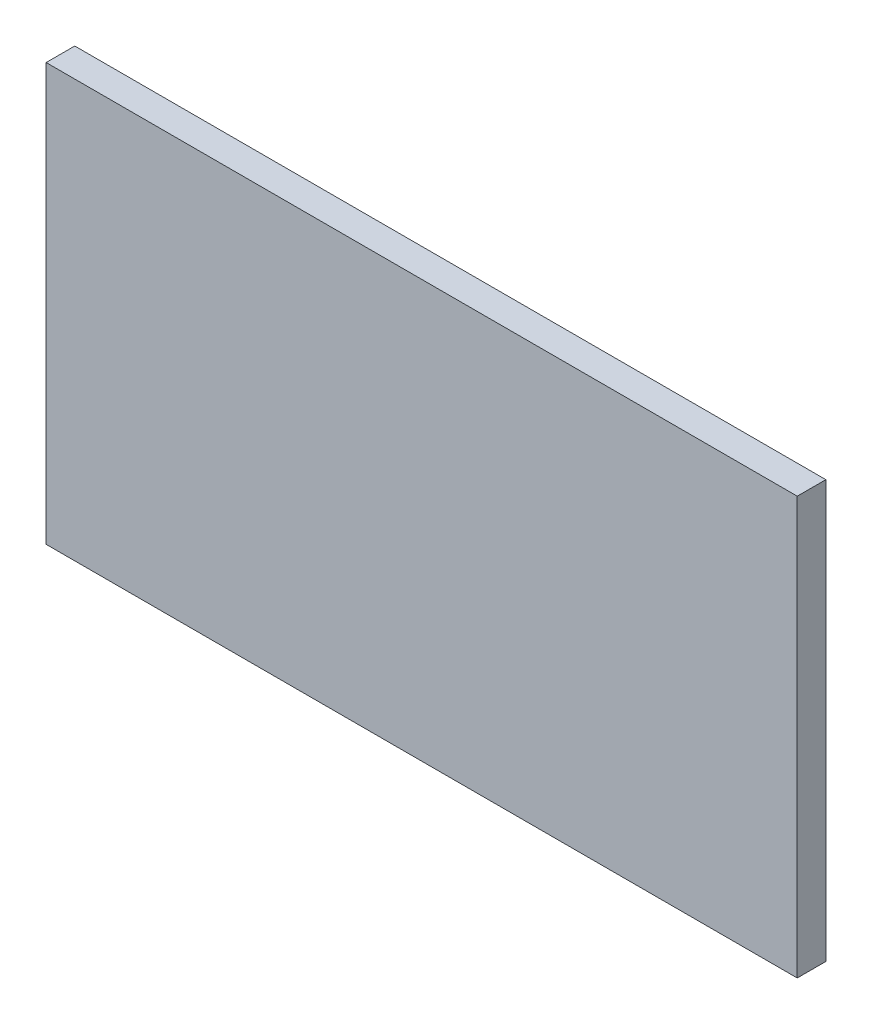
ISO-10303-21;
HEADER;
FILE_DESCRIPTION(('STEP AP214'),'2;1');
FILE_NAME('part.step','',(''),(''),'','','');
FILE_SCHEMA(('AUTOMOTIVE_DESIGN { 1 0 10303 214 1 1 1 1 }'));
ENDSEC;
DATA;
#1=APPLICATION_CONTEXT('core data for automotive mechanical design processes');
#2=APPLICATION_PROTOCOL_DEFINITION('international standard','automotive_design',2000,#1);
#3=PRODUCT_CONTEXT('',#1,'mechanical');
#4=PRODUCT('Part','Part','',(#3));
#5=PRODUCT_RELATED_PRODUCT_CATEGORY('part','',(#4));
#6=PRODUCT_DEFINITION_FORMATION('','',#4);
#7=PRODUCT_DEFINITION_CONTEXT('part definition',#1,'design');
#8=PRODUCT_DEFINITION('design','',#6,#7);
#9=PRODUCT_DEFINITION_SHAPE('','',#8);
#10=(LENGTH_UNIT() NAMED_UNIT(*) SI_UNIT(.MILLI.,.METRE.));
#11=(NAMED_UNIT(*) PLANE_ANGLE_UNIT() SI_UNIT($,.RADIAN.));
#12=(NAMED_UNIT(*) SI_UNIT($,.STERADIAN.) SOLID_ANGLE_UNIT());
#13=UNCERTAINTY_MEASURE_WITH_UNIT(LENGTH_MEASURE(1.E-05),#10,'distance_accuracy_value','');
#14=(GEOMETRIC_REPRESENTATION_CONTEXT(3) GLOBAL_UNCERTAINTY_ASSIGNED_CONTEXT((#13)) GLOBAL_UNIT_ASSIGNED_CONTEXT((#10,
#11,#12)) REPRESENTATION_CONTEXT('',''));
#15=CARTESIAN_POINT('',(0.,0.,0.));
#16=DIRECTION('',(0.,0.,1.));
#17=DIRECTION('',(1.,0.,0.));
#18=AXIS2_PLACEMENT_3D('',#15,#16,#17);
#19=CARTESIAN_POINT('',(12.50008,3.2,0.));
#20=DIRECTION('',(0.,0.,-1.));
#21=DIRECTION('',(-1.,0.,0.));
#22=AXIS2_PLACEMENT_3D('',#19,#20,#21);
#23=PLANE('',#22);
#24=DIRECTION('',(1.,0.,0.));
#25=VECTOR('',#24,1.);
#26=CARTESIAN_POINT('',(12.05008,3.45,0.));
#27=LINE('',#26,#25);
#28=CARTESIAN_POINT('',(12.05008,3.45,0.));
#29=VERTEX_POINT('',#28);
#30=CARTESIAN_POINT('',(12.95008,3.45,0.));
#31=VERTEX_POINT('',#30);
#32=EDGE_CURVE('E55',#29,#31,#27,.T.);
#33=ORIENTED_EDGE('',*,*,#32,.T.);
#34=DIRECTION('',(0.,1.,0.));
#35=VECTOR('',#34,1.);
#36=CARTESIAN_POINT('',(12.95008,3.45,0.));
#37=LINE('',#36,#35);
#38=CARTESIAN_POINT('',(12.95008,2.95,0.));
#39=VERTEX_POINT('',#38);
#40=EDGE_CURVE('E57',#31,#39,#37,.F.);
#41=ORIENTED_EDGE('',*,*,#40,.T.);
#42=DIRECTION('',(1.,0.,0.));
#43=VECTOR('',#42,1.);
#44=CARTESIAN_POINT('',(12.95008,2.95,0.));
#45=LINE('',#44,#43);
#46=CARTESIAN_POINT('',(12.05008,2.95,0.));
#47=VERTEX_POINT('',#46);
#48=EDGE_CURVE('E20',#39,#47,#45,.F.);
#49=ORIENTED_EDGE('',*,*,#48,.T.);
#50=DIRECTION('',(0.,1.,0.));
#51=VECTOR('',#50,1.);
#52=CARTESIAN_POINT('',(12.05008,2.95,0.));
#53=LINE('',#52,#51);
#54=EDGE_CURVE('E80',#47,#29,#53,.T.);
#55=ORIENTED_EDGE('',*,*,#54,.T.);
#56=EDGE_LOOP('',(#33,#41,#49,#55));
#57=FACE_BOUND('',#56,.T.);
#58=ADVANCED_FACE('F17',(#57),#23,.T.);
#59=CARTESIAN_POINT('',(12.95008,2.95,0.));
#60=DIRECTION('',(0.,1.,0.));
#61=DIRECTION('',(0.,0.,1.));
#62=AXIS2_PLACEMENT_3D('',#59,#60,#61);
#63=PLANE('',#62);
#64=DIRECTION('',(0.,0.,-1.));
#65=VECTOR('',#64,1.);
#66=CARTESIAN_POINT('',(12.05008,2.95,0.));
#67=LINE('',#66,#65);
#68=CARTESIAN_POINT('',(12.05008,2.95,0.03429));
#69=VERTEX_POINT('',#68);
#70=EDGE_CURVE('E68',#69,#47,#67,.T.);
#71=ORIENTED_EDGE('',*,*,#70,.T.);
#72=ORIENTED_EDGE('',*,*,#48,.F.);
#73=DIRECTION('',(0.,0.,1.));
#74=VECTOR('',#73,1.);
#75=CARTESIAN_POINT('',(12.95008,2.95,0.));
#76=LINE('',#75,#74);
#77=CARTESIAN_POINT('',(12.95008,2.95,0.03429));
#78=VERTEX_POINT('',#77);
#79=EDGE_CURVE('E63',#39,#78,#76,.T.);
#80=ORIENTED_EDGE('',*,*,#79,.T.);
#81=DIRECTION('',(1.,0.,0.));
#82=VECTOR('',#81,1.);
#83=CARTESIAN_POINT('',(12.50008,2.95,0.03429));
#84=LINE('',#83,#82);
#85=EDGE_CURVE('E83',#69,#78,#84,.T.);
#86=ORIENTED_EDGE('',*,*,#85,.F.);
#87=EDGE_LOOP('',(#71,#72,#80,#86));
#88=FACE_BOUND('',#87,.T.);
#89=ADVANCED_FACE('F65',(#88),#63,.F.);
#90=CARTESIAN_POINT('',(12.95008,3.45,0.));
#91=DIRECTION('',(-1.,0.,0.));
#92=DIRECTION('',(0.,0.,1.));
#93=AXIS2_PLACEMENT_3D('',#90,#91,#92);
#94=PLANE('',#93);
#95=ORIENTED_EDGE('',*,*,#79,.F.);
#96=ORIENTED_EDGE('',*,*,#40,.F.);
#97=DIRECTION('',(0.,0.,-1.));
#98=VECTOR('',#97,1.);
#99=CARTESIAN_POINT('',(12.95008,3.45,0.));
#100=LINE('',#99,#98);
#101=CARTESIAN_POINT('',(12.95008,3.45,0.03429));
#102=VERTEX_POINT('',#101);
#103=EDGE_CURVE('E75',#31,#102,#100,.F.);
#104=ORIENTED_EDGE('',*,*,#103,.T.);
#105=DIRECTION('',(0.,1.,0.));
#106=VECTOR('',#105,1.);
#107=CARTESIAN_POINT('',(12.95008,3.2,0.03429));
#108=LINE('',#107,#106);
#109=EDGE_CURVE('E72',#78,#102,#108,.T.);
#110=ORIENTED_EDGE('',*,*,#109,.F.);
#111=EDGE_LOOP('',(#95,#96,#104,#110));
#112=FACE_BOUND('',#111,.T.);
#113=ADVANCED_FACE('F70',(#112),#94,.F.);
#114=CARTESIAN_POINT('',(12.05008,3.45,0.));
#115=DIRECTION('',(0.,-1.,0.));
#116=DIRECTION('',(0.,0.,-1.));
#117=AXIS2_PLACEMENT_3D('',#114,#115,#116);
#118=PLANE('',#117);
#119=ORIENTED_EDGE('',*,*,#103,.F.);
#120=ORIENTED_EDGE('',*,*,#32,.F.);
#121=DIRECTION('',(0.,0.,-1.));
#122=VECTOR('',#121,1.);
#123=CARTESIAN_POINT('',(12.05008,3.45,0.));
#124=LINE('',#123,#122);
#125=CARTESIAN_POINT('',(12.05008,3.45,0.03429));
#126=VERTEX_POINT('',#125);
#127=EDGE_CURVE('E35',#29,#126,#124,.F.);
#128=ORIENTED_EDGE('',*,*,#127,.T.);
#129=DIRECTION('',(1.,0.,0.));
#130=VECTOR('',#129,1.);
#131=CARTESIAN_POINT('',(12.50008,3.45,0.03429));
#132=LINE('',#131,#130);
#133=EDGE_CURVE('E26',#102,#126,#132,.F.);
#134=ORIENTED_EDGE('',*,*,#133,.F.);
#135=EDGE_LOOP('',(#119,#120,#128,#134));
#136=FACE_BOUND('',#135,.T.);
#137=ADVANCED_FACE('F89',(#136),#118,.F.);
#138=CARTESIAN_POINT('',(12.05008,2.95,0.));
#139=DIRECTION('',(1.,0.,0.));
#140=DIRECTION('',(0.,0.,-1.));
#141=AXIS2_PLACEMENT_3D('',#138,#139,#140);
#142=PLANE('',#141);
#143=ORIENTED_EDGE('',*,*,#127,.F.);
#144=ORIENTED_EDGE('',*,*,#54,.F.);
#145=ORIENTED_EDGE('',*,*,#70,.F.);
#146=DIRECTION('',(0.,1.,0.));
#147=VECTOR('',#146,1.);
#148=CARTESIAN_POINT('',(12.05008,3.2,0.03429));
#149=LINE('',#148,#147);
#150=EDGE_CURVE('E11',#126,#69,#149,.F.);
#151=ORIENTED_EDGE('',*,*,#150,.F.);
#152=EDGE_LOOP('',(#143,#144,#145,#151));
#153=FACE_BOUND('',#152,.T.);
#154=ADVANCED_FACE('F91',(#153),#142,.F.);
#155=CARTESIAN_POINT('',(12.50008,3.2,0.03429));
#156=DIRECTION('',(0.,0.,1.));
#157=DIRECTION('',(1.,0.,0.));
#158=AXIS2_PLACEMENT_3D('',#155,#156,#157);
#159=PLANE('',#158);
#160=ORIENTED_EDGE('',*,*,#133,.T.);
#161=ORIENTED_EDGE('',*,*,#150,.T.);
#162=ORIENTED_EDGE('',*,*,#85,.T.);
#163=ORIENTED_EDGE('',*,*,#109,.T.);
#164=EDGE_LOOP('',(#160,#161,#162,#163));
#165=FACE_BOUND('',#164,.T.);
#166=ADVANCED_FACE('F88',(#165),#159,.T.);
#167=CLOSED_SHELL('',(#58,#89,#113,#137,#154,#166));
#168=MANIFOLD_SOLID_BREP('B1',#167);
#169=ADVANCED_BREP_SHAPE_REPRESENTATION('',(#18,#168),#14);
#170=SHAPE_DEFINITION_REPRESENTATION(#9,#169);
ENDSEC;
END-ISO-10303-21;
